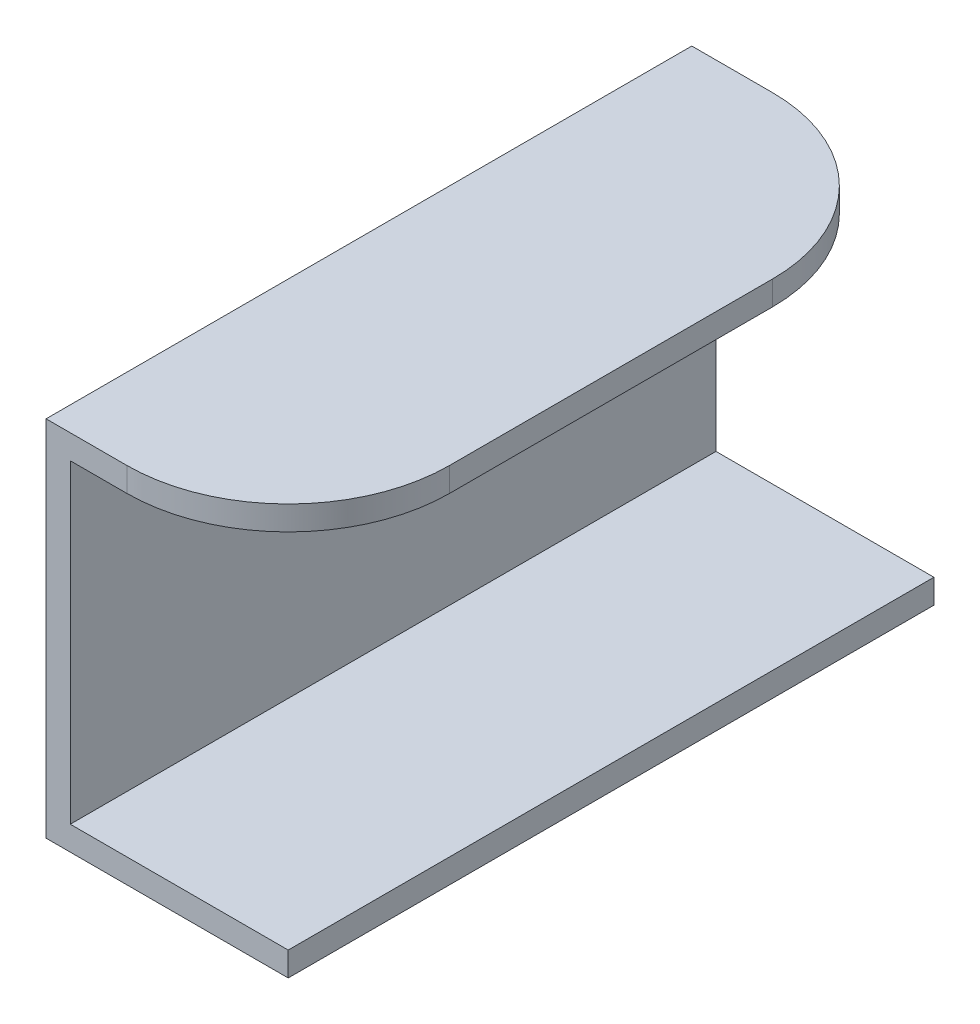
ISO-10303-21;
HEADER;
FILE_DESCRIPTION(('STEP AP214'),'2;1');
FILE_NAME('part.step','',(''),(''),'','','');
FILE_SCHEMA(('AUTOMOTIVE_DESIGN { 1 0 10303 214 1 1 1 1 }'));
ENDSEC;
DATA;
#1=APPLICATION_CONTEXT('core data for automotive mechanical design processes');
#2=APPLICATION_PROTOCOL_DEFINITION('international standard','automotive_design',2000,#1);
#3=PRODUCT_CONTEXT('',#1,'mechanical');
#4=PRODUCT('Part','Part','',(#3));
#5=PRODUCT_RELATED_PRODUCT_CATEGORY('part','',(#4));
#6=PRODUCT_DEFINITION_FORMATION('','',#4);
#7=PRODUCT_DEFINITION_CONTEXT('part definition',#1,'design');
#8=PRODUCT_DEFINITION('design','',#6,#7);
#9=PRODUCT_DEFINITION_SHAPE('','',#8);
#10=(LENGTH_UNIT() NAMED_UNIT(*) SI_UNIT(.MILLI.,.METRE.));
#11=(NAMED_UNIT(*) PLANE_ANGLE_UNIT() SI_UNIT($,.RADIAN.));
#12=(NAMED_UNIT(*) SI_UNIT($,.STERADIAN.) SOLID_ANGLE_UNIT());
#13=UNCERTAINTY_MEASURE_WITH_UNIT(LENGTH_MEASURE(1.E-05),#10,'distance_accuracy_value','');
#14=(GEOMETRIC_REPRESENTATION_CONTEXT(3) GLOBAL_UNCERTAINTY_ASSIGNED_CONTEXT((#13)) GLOBAL_UNIT_ASSIGNED_CONTEXT((#10,
#11,#12)) REPRESENTATION_CONTEXT('',''));
#15=CARTESIAN_POINT('',(0.,0.,0.));
#16=DIRECTION('',(0.,0.,1.));
#17=DIRECTION('',(1.,0.,0.));
#18=AXIS2_PLACEMENT_3D('',#15,#16,#17);
#19=CARTESIAN_POINT('',(0.1,0.3375,-0.2));
#20=DIRECTION('',(0.,1.,0.));
#21=DIRECTION('',(0.,0.,1.));
#22=AXIS2_PLACEMENT_3D('',#19,#20,#21);
#23=CYLINDRICAL_SURFACE('',#22,0.2);
#24=CARTESIAN_POINT('',(0.1,0.42,-0.2));
#25=DIRECTION('',(0.,1.,0.));
#26=DIRECTION('',(0.,0.,1.));
#27=AXIS2_PLACEMENT_3D('',#24,#25,#26);
#28=CIRCLE('',#27,0.2);
#29=CARTESIAN_POINT('',(0.3,0.42,-0.2));
#30=VERTEX_POINT('',#29);
#31=CARTESIAN_POINT('',(0.1,0.42,0.));
#32=VERTEX_POINT('',#31);
#33=EDGE_CURVE('E138',#30,#32,#28,.F.);
#34=ORIENTED_EDGE('',*,*,#33,.F.);
#35=DIRECTION('',(0.,1.,0.));
#36=VECTOR('',#35,1.);
#37=CARTESIAN_POINT('',(0.3,0.45,-0.2));
#38=LINE('',#37,#36);
#39=CARTESIAN_POINT('',(0.3,0.45,-0.2));
#40=VERTEX_POINT('',#39);
#41=EDGE_CURVE('E150',#40,#30,#38,.F.);
#42=ORIENTED_EDGE('',*,*,#41,.F.);
#43=CARTESIAN_POINT('',(0.1,0.45,-0.2));
#44=DIRECTION('',(0.,1.,0.));
#45=DIRECTION('',(0.,0.,1.));
#46=AXIS2_PLACEMENT_3D('',#43,#44,#45);
#47=CIRCLE('',#46,0.2);
#48=CARTESIAN_POINT('',(0.1,0.45,0.));
#49=VERTEX_POINT('',#48);
#50=EDGE_CURVE('E117',#49,#40,#47,.T.);
#51=ORIENTED_EDGE('',*,*,#50,.F.);
#52=DIRECTION('',(0.,1.,0.));
#53=VECTOR('',#52,1.);
#54=CARTESIAN_POINT('',(0.1,0.225,0.));
#55=LINE('',#54,#53);
#56=EDGE_CURVE('E152',#32,#49,#55,.T.);
#57=ORIENTED_EDGE('',*,*,#56,.F.);
#58=EDGE_LOOP('',(#34,#42,#51,#57));
#59=FACE_BOUND('',#58,.T.);
#60=ADVANCED_FACE('F17',(#59),#23,.T.);
#61=CARTESIAN_POINT('',(0.3,0.45,0.));
#62=DIRECTION('',(1.,0.,0.));
#63=DIRECTION('',(0.,0.,-1.));
#64=AXIS2_PLACEMENT_3D('',#61,#62,#63);
#65=PLANE('',#64);
#66=ORIENTED_EDGE('',*,*,#41,.T.);
#67=DIRECTION('',(0.,0.,-1.));
#68=VECTOR('',#67,1.);
#69=CARTESIAN_POINT('',(0.3,0.42,0.));
#70=LINE('',#69,#68);
#71=CARTESIAN_POINT('',(0.3,0.42,-0.6));
#72=VERTEX_POINT('',#71);
#73=EDGE_CURVE('E101',#72,#30,#70,.F.);
#74=ORIENTED_EDGE('',*,*,#73,.F.);
#75=DIRECTION('',(0.,-1.,0.));
#76=VECTOR('',#75,1.);
#77=CARTESIAN_POINT('',(0.3,0.3375,-0.6));
#78=LINE('',#77,#76);
#79=CARTESIAN_POINT('',(0.3,0.45,-0.6));
#80=VERTEX_POINT('',#79);
#81=EDGE_CURVE('E97',#80,#72,#78,.T.);
#82=ORIENTED_EDGE('',*,*,#81,.F.);
#83=DIRECTION('',(0.,0.,1.));
#84=VECTOR('',#83,1.);
#85=CARTESIAN_POINT('',(0.3,0.45,0.));
#86=LINE('',#85,#84);
#87=EDGE_CURVE('E114',#40,#80,#86,.F.);
#88=ORIENTED_EDGE('',*,*,#87,.F.);
#89=EDGE_LOOP('',(#66,#74,#82,#88));
#90=FACE_BOUND('',#89,.T.);
#91=ADVANCED_FACE('F256',(#90),#65,.T.);
#92=CARTESIAN_POINT('',(0.1,0.3375,-0.6));
#93=DIRECTION('',(0.,-1.,0.));
#94=DIRECTION('',(0.,0.,-1.));
#95=AXIS2_PLACEMENT_3D('',#92,#93,#94);
#96=CYLINDRICAL_SURFACE('',#95,0.2);
#97=CARTESIAN_POINT('',(0.1,0.42,-0.6));
#98=DIRECTION('',(0.,-1.,0.));
#99=DIRECTION('',(0.,0.,-1.));
#100=AXIS2_PLACEMENT_3D('',#97,#98,#99);
#101=CIRCLE('',#100,0.2);
#102=CARTESIAN_POINT('',(0.1,0.42,-0.8));
#103=VERTEX_POINT('',#102);
#104=EDGE_CURVE('E20',#103,#72,#101,.T.);
#105=ORIENTED_EDGE('',*,*,#104,.F.);
#106=DIRECTION('',(0.,1.,0.));
#107=VECTOR('',#106,1.);
#108=CARTESIAN_POINT('',(0.1,0.225,-0.8));
#109=LINE('',#108,#107);
#110=CARTESIAN_POINT('',(0.1,0.45,-0.8));
#111=VERTEX_POINT('',#110);
#112=EDGE_CURVE('E95',#111,#103,#109,.F.);
#113=ORIENTED_EDGE('',*,*,#112,.F.);
#114=CARTESIAN_POINT('',(0.1,0.45,-0.6));
#115=DIRECTION('',(0.,-1.,0.));
#116=DIRECTION('',(0.,0.,-1.));
#117=AXIS2_PLACEMENT_3D('',#114,#115,#116);
#118=CIRCLE('',#117,0.2);
#119=EDGE_CURVE('E165',#80,#111,#118,.F.);
#120=ORIENTED_EDGE('',*,*,#119,.F.);
#121=ORIENTED_EDGE('',*,*,#81,.T.);
#122=EDGE_LOOP('',(#105,#113,#120,#121));
#123=FACE_BOUND('',#122,.T.);
#124=ADVANCED_FACE('F92',(#123),#96,.T.);
#125=CARTESIAN_POINT('',(0.3,0.42,0.));
#126=DIRECTION('',(0.,-1.,0.));
#127=DIRECTION('',(0.,0.,-1.));
#128=AXIS2_PLACEMENT_3D('',#125,#126,#127);
#129=PLANE('',#128);
#130=DIRECTION('',(0.,0.,-1.));
#131=VECTOR('',#130,1.);
#132=CARTESIAN_POINT('',(0.03,0.42,0.));
#133=LINE('',#132,#131);
#134=CARTESIAN_POINT('',(0.03,0.42,-0.8));
#135=VERTEX_POINT('',#134);
#136=CARTESIAN_POINT('',(0.03,0.42,0.));
#137=VERTEX_POINT('',#136);
#138=EDGE_CURVE('E106',#135,#137,#133,.F.);
#139=ORIENTED_EDGE('',*,*,#138,.F.);
#140=DIRECTION('',(-1.,0.,0.));
#141=VECTOR('',#140,1.);
#142=CARTESIAN_POINT('',(0.102352941176,0.42,-0.8));
#143=LINE('',#142,#141);
#144=EDGE_CURVE('E103',#103,#135,#143,.T.);
#145=ORIENTED_EDGE('',*,*,#144,.F.);
#146=ORIENTED_EDGE('',*,*,#104,.T.);
#147=ORIENTED_EDGE('',*,*,#73,.T.);
#148=ORIENTED_EDGE('',*,*,#33,.T.);
#149=DIRECTION('',(1.,0.,0.));
#150=VECTOR('',#149,1.);
#151=CARTESIAN_POINT('',(0.102352941176,0.42,0.));
#152=LINE('',#151,#150);
#153=EDGE_CURVE('E162',#137,#32,#152,.T.);
#154=ORIENTED_EDGE('',*,*,#153,.F.);
#155=EDGE_LOOP('',(#139,#145,#146,#147,#148,#154));
#156=FACE_BOUND('',#155,.T.);
#157=ADVANCED_FACE('F104',(#156),#129,.T.);
#158=CARTESIAN_POINT('',(0.03,0.42,0.));
#159=DIRECTION('',(1.,0.,0.));
#160=DIRECTION('',(0.,0.,-1.));
#161=AXIS2_PLACEMENT_3D('',#158,#159,#160);
#162=PLANE('',#161);
#163=DIRECTION('',(0.,1.,0.));
#164=VECTOR('',#163,1.);
#165=CARTESIAN_POINT('',(0.03,0.225,-0.8));
#166=LINE('',#165,#164);
#167=CARTESIAN_POINT('',(0.03,0.03,-0.8));
#168=VERTEX_POINT('',#167);
#169=EDGE_CURVE('E109',#135,#168,#166,.F.);
#170=ORIENTED_EDGE('',*,*,#169,.F.);
#171=ORIENTED_EDGE('',*,*,#138,.T.);
#172=DIRECTION('',(0.,1.,0.));
#173=VECTOR('',#172,1.);
#174=CARTESIAN_POINT('',(0.03,0.225,0.));
#175=LINE('',#174,#173);
#176=CARTESIAN_POINT('',(0.03,0.03,0.));
#177=VERTEX_POINT('',#176);
#178=EDGE_CURVE('E166',#177,#137,#175,.T.);
#179=ORIENTED_EDGE('',*,*,#178,.F.);
#180=DIRECTION('',(0.,0.,1.));
#181=VECTOR('',#180,1.);
#182=CARTESIAN_POINT('',(0.03,0.03,0.));
#183=LINE('',#182,#181);
#184=EDGE_CURVE('E147',#168,#177,#183,.T.);
#185=ORIENTED_EDGE('',*,*,#184,.F.);
#186=EDGE_LOOP('',(#170,#171,#179,#185));
#187=FACE_BOUND('',#186,.T.);
#188=ADVANCED_FACE('F215',(#187),#162,.T.);
#189=CARTESIAN_POINT('',(0.03,0.03,0.));
#190=DIRECTION('',(0.,1.,0.));
#191=DIRECTION('',(0.,0.,1.));
#192=AXIS2_PLACEMENT_3D('',#189,#190,#191);
#193=PLANE('',#192);
#194=DIRECTION('',(-1.,0.,0.));
#195=VECTOR('',#194,1.);
#196=CARTESIAN_POINT('',(0.102352941176,0.03,-0.8));
#197=LINE('',#196,#195);
#198=CARTESIAN_POINT('',(0.3,0.03,-0.8));
#199=VERTEX_POINT('',#198);
#200=EDGE_CURVE('E143',#168,#199,#197,.F.);
#201=ORIENTED_EDGE('',*,*,#200,.F.);
#202=ORIENTED_EDGE('',*,*,#184,.T.);
#203=DIRECTION('',(1.,0.,0.));
#204=VECTOR('',#203,1.);
#205=CARTESIAN_POINT('',(0.102352941176,0.03,0.));
#206=LINE('',#205,#204);
#207=CARTESIAN_POINT('',(0.3,0.03,0.));
#208=VERTEX_POINT('',#207);
#209=EDGE_CURVE('E171',#208,#177,#206,.F.);
#210=ORIENTED_EDGE('',*,*,#209,.F.);
#211=DIRECTION('',(0.,0.,-1.));
#212=VECTOR('',#211,1.);
#213=CARTESIAN_POINT('',(0.3,0.03,0.));
#214=LINE('',#213,#212);
#215=EDGE_CURVE('E155',#199,#208,#214,.F.);
#216=ORIENTED_EDGE('',*,*,#215,.F.);
#217=EDGE_LOOP('',(#201,#202,#210,#216));
#218=FACE_BOUND('',#217,.T.);
#219=ADVANCED_FACE('F220',(#218),#193,.T.);
#220=CARTESIAN_POINT('',(0.3,0.03,0.));
#221=DIRECTION('',(1.,0.,0.));
#222=DIRECTION('',(0.,0.,-1.));
#223=AXIS2_PLACEMENT_3D('',#220,#221,#222);
#224=PLANE('',#223);
#225=DIRECTION('',(0.,1.,0.));
#226=VECTOR('',#225,1.);
#227=CARTESIAN_POINT('',(0.3,0.225,-0.8));
#228=LINE('',#227,#226);
#229=CARTESIAN_POINT('',(0.3,0.,-0.8));
#230=VERTEX_POINT('',#229);
#231=EDGE_CURVE('E125',#199,#230,#228,.F.);
#232=ORIENTED_EDGE('',*,*,#231,.F.);
#233=ORIENTED_EDGE('',*,*,#215,.T.);
#234=DIRECTION('',(0.,1.,0.));
#235=VECTOR('',#234,1.);
#236=CARTESIAN_POINT('',(0.3,0.225,0.));
#237=LINE('',#236,#235);
#238=CARTESIAN_POINT('',(0.3,0.,0.));
#239=VERTEX_POINT('',#238);
#240=EDGE_CURVE('E154',#239,#208,#237,.T.);
#241=ORIENTED_EDGE('',*,*,#240,.F.);
#242=DIRECTION('',(0.,0.,-1.));
#243=VECTOR('',#242,1.);
#244=CARTESIAN_POINT('',(0.3,0.,0.));
#245=LINE('',#244,#243);
#246=EDGE_CURVE('E158',#230,#239,#245,.F.);
#247=ORIENTED_EDGE('',*,*,#246,.F.);
#248=EDGE_LOOP('',(#232,#233,#241,#247));
#249=FACE_BOUND('',#248,.T.);
#250=ADVANCED_FACE('F222',(#249),#224,.T.);
#251=CARTESIAN_POINT('',(0.102352941176,0.225,0.));
#252=DIRECTION('',(0.,0.,1.));
#253=DIRECTION('',(1.,0.,0.));
#254=AXIS2_PLACEMENT_3D('',#251,#252,#253);
#255=PLANE('',#254);
#256=ORIENTED_EDGE('',*,*,#178,.T.);
#257=ORIENTED_EDGE('',*,*,#153,.T.);
#258=ORIENTED_EDGE('',*,*,#56,.T.);
#259=DIRECTION('',(1.,0.,0.));
#260=VECTOR('',#259,1.);
#261=CARTESIAN_POINT('',(0.,0.45,0.));
#262=LINE('',#261,#260);
#263=CARTESIAN_POINT('',(0.,0.45,0.));
#264=VERTEX_POINT('',#263);
#265=EDGE_CURVE('E205',#264,#49,#262,.T.);
#266=ORIENTED_EDGE('',*,*,#265,.F.);
#267=DIRECTION('',(0.,1.,0.));
#268=VECTOR('',#267,1.);
#269=CARTESIAN_POINT('',(0.,0.,0.));
#270=LINE('',#269,#268);
#271=CARTESIAN_POINT('',(0.,0.,0.));
#272=VERTEX_POINT('',#271);
#273=EDGE_CURVE('E135',#272,#264,#270,.T.);
#274=ORIENTED_EDGE('',*,*,#273,.F.);
#275=DIRECTION('',(1.,0.,0.));
#276=VECTOR('',#275,1.);
#277=CARTESIAN_POINT('',(0.3,0.,0.));
#278=LINE('',#277,#276);
#279=EDGE_CURVE('E124',#239,#272,#278,.F.);
#280=ORIENTED_EDGE('',*,*,#279,.F.);
#281=ORIENTED_EDGE('',*,*,#240,.T.);
#282=ORIENTED_EDGE('',*,*,#209,.T.);
#283=EDGE_LOOP('',(#256,#257,#258,#266,#274,#280,#281,#282));
#284=FACE_BOUND('',#283,.T.);
#285=ADVANCED_FACE('F210',(#284),#255,.T.);
#286=CARTESIAN_POINT('',(0.,0.45,0.));
#287=DIRECTION('',(0.,1.,0.));
#288=DIRECTION('',(0.,0.,1.));
#289=AXIS2_PLACEMENT_3D('',#286,#287,#288);
#290=PLANE('',#289);
#291=ORIENTED_EDGE('',*,*,#50,.T.);
#292=ORIENTED_EDGE('',*,*,#87,.T.);
#293=ORIENTED_EDGE('',*,*,#119,.T.);
#294=DIRECTION('',(-1.,0.,0.));
#295=VECTOR('',#294,1.);
#296=CARTESIAN_POINT('',(0.102352941176,0.45,-0.8));
#297=LINE('',#296,#295);
#298=CARTESIAN_POINT('',(0.,0.45,-0.8));
#299=VERTEX_POINT('',#298);
#300=EDGE_CURVE('E113',#299,#111,#297,.F.);
#301=ORIENTED_EDGE('',*,*,#300,.F.);
#302=DIRECTION('',(0.,0.,1.));
#303=VECTOR('',#302,1.);
#304=CARTESIAN_POINT('',(0.,0.45,0.));
#305=LINE('',#304,#303);
#306=EDGE_CURVE('E130',#264,#299,#305,.F.);
#307=ORIENTED_EDGE('',*,*,#306,.F.);
#308=ORIENTED_EDGE('',*,*,#265,.T.);
#309=EDGE_LOOP('',(#291,#292,#293,#301,#307,#308));
#310=FACE_BOUND('',#309,.T.);
#311=ADVANCED_FACE('F230',(#310),#290,.T.);
#312=CARTESIAN_POINT('',(0.102352941176,0.225,-0.8));
#313=DIRECTION('',(0.,0.,-1.));
#314=DIRECTION('',(-1.,0.,0.));
#315=AXIS2_PLACEMENT_3D('',#312,#313,#314);
#316=PLANE('',#315);
#317=DIRECTION('',(0.,1.,0.));
#318=VECTOR('',#317,1.);
#319=CARTESIAN_POINT('',(0.,0.,-0.8));
#320=LINE('',#319,#318);
#321=CARTESIAN_POINT('',(0.,0.,-0.8));
#322=VERTEX_POINT('',#321);
#323=EDGE_CURVE('E26',#299,#322,#320,.F.);
#324=ORIENTED_EDGE('',*,*,#323,.F.);
#325=ORIENTED_EDGE('',*,*,#300,.T.);
#326=ORIENTED_EDGE('',*,*,#112,.T.);
#327=ORIENTED_EDGE('',*,*,#144,.T.);
#328=ORIENTED_EDGE('',*,*,#169,.T.);
#329=ORIENTED_EDGE('',*,*,#200,.T.);
#330=ORIENTED_EDGE('',*,*,#231,.T.);
#331=DIRECTION('',(1.,0.,0.));
#332=VECTOR('',#331,1.);
#333=CARTESIAN_POINT('',(0.3,0.,-0.8));
#334=LINE('',#333,#332);
#335=EDGE_CURVE('E35',#322,#230,#334,.T.);
#336=ORIENTED_EDGE('',*,*,#335,.F.);
#337=EDGE_LOOP('',(#324,#325,#326,#327,#328,#329,#330,#336));
#338=FACE_BOUND('',#337,.T.);
#339=ADVANCED_FACE('F112',(#338),#316,.T.);
#340=CARTESIAN_POINT('',(0.3,0.,0.));
#341=DIRECTION('',(0.,-1.,0.));
#342=DIRECTION('',(0.,0.,-1.));
#343=AXIS2_PLACEMENT_3D('',#340,#341,#342);
#344=PLANE('',#343);
#345=ORIENTED_EDGE('',*,*,#335,.T.);
#346=ORIENTED_EDGE('',*,*,#246,.T.);
#347=ORIENTED_EDGE('',*,*,#279,.T.);
#348=DIRECTION('',(0.,0.,1.));
#349=VECTOR('',#348,1.);
#350=CARTESIAN_POINT('',(0.,0.,0.));
#351=LINE('',#350,#349);
#352=EDGE_CURVE('E11',#322,#272,#351,.T.);
#353=ORIENTED_EDGE('',*,*,#352,.F.);
#354=EDGE_LOOP('',(#345,#346,#347,#353));
#355=FACE_BOUND('',#354,.T.);
#356=ADVANCED_FACE('F225',(#355),#344,.T.);
#357=CARTESIAN_POINT('',(0.,0.,0.));
#358=DIRECTION('',(-1.,0.,0.));
#359=DIRECTION('',(0.,0.,1.));
#360=AXIS2_PLACEMENT_3D('',#357,#358,#359);
#361=PLANE('',#360);
#362=ORIENTED_EDGE('',*,*,#323,.T.);
#363=ORIENTED_EDGE('',*,*,#352,.T.);
#364=ORIENTED_EDGE('',*,*,#273,.T.);
#365=ORIENTED_EDGE('',*,*,#306,.T.);
#366=EDGE_LOOP('',(#362,#363,#364,#365));
#367=FACE_BOUND('',#366,.T.);
#368=ADVANCED_FACE('F232',(#367),#361,.T.);
#369=CLOSED_SHELL('',(#60,#91,#124,#157,#188,#219,#250,#285,#311,#339,#356,#368));
#370=MANIFOLD_SOLID_BREP('B1',#369);
#371=ADVANCED_BREP_SHAPE_REPRESENTATION('',(#18,#370),#14);
#372=SHAPE_DEFINITION_REPRESENTATION(#9,#371);
ENDSEC;
END-ISO-10303-21;
